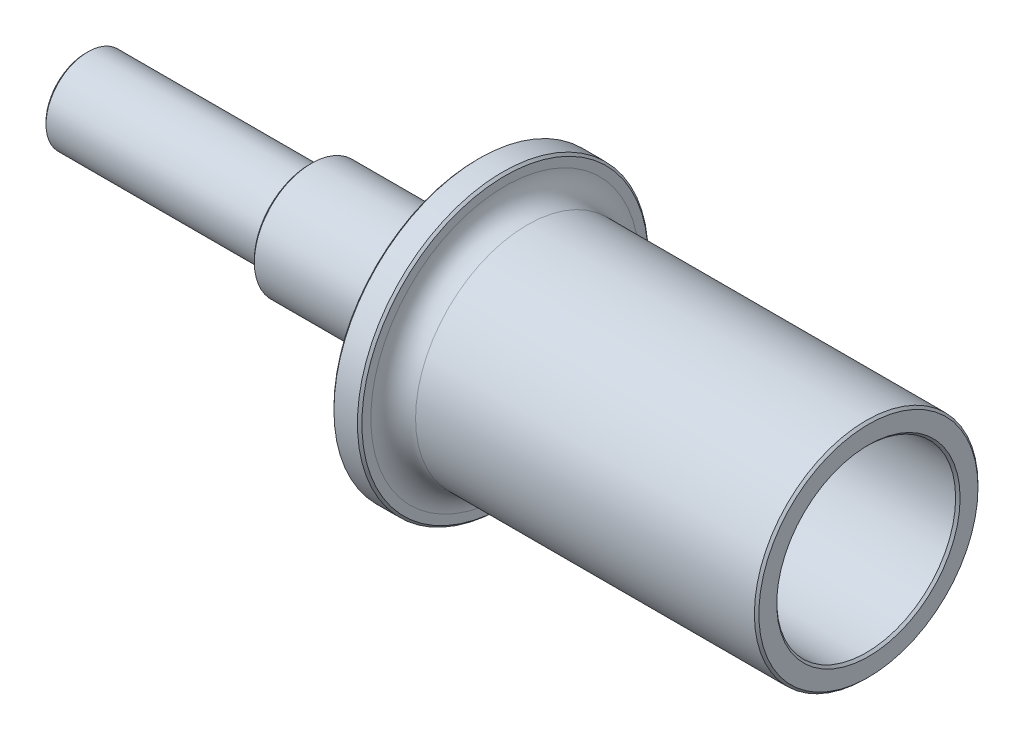
ISO-10303-21;
HEADER;
FILE_DESCRIPTION(('STEP AP214'),'2;1');
FILE_NAME('part.step','',(''),(''),'','','');
FILE_SCHEMA(('AUTOMOTIVE_DESIGN { 1 0 10303 214 1 1 1 1 }'));
ENDSEC;
DATA;
#1=APPLICATION_CONTEXT('core data for automotive mechanical design processes');
#2=APPLICATION_PROTOCOL_DEFINITION('international standard','automotive_design',2000,#1);
#3=PRODUCT_CONTEXT('',#1,'mechanical');
#4=PRODUCT('Part','Part','',(#3));
#5=PRODUCT_RELATED_PRODUCT_CATEGORY('part','',(#4));
#6=PRODUCT_DEFINITION_FORMATION('','',#4);
#7=PRODUCT_DEFINITION_CONTEXT('part definition',#1,'design');
#8=PRODUCT_DEFINITION('design','',#6,#7);
#9=PRODUCT_DEFINITION_SHAPE('','',#8);
#10=(LENGTH_UNIT() NAMED_UNIT(*) SI_UNIT(.MILLI.,.METRE.));
#11=(NAMED_UNIT(*) PLANE_ANGLE_UNIT() SI_UNIT($,.RADIAN.));
#12=(NAMED_UNIT(*) SI_UNIT($,.STERADIAN.) SOLID_ANGLE_UNIT());
#13=UNCERTAINTY_MEASURE_WITH_UNIT(LENGTH_MEASURE(1.E-05),#10,'distance_accuracy_value','');
#14=(GEOMETRIC_REPRESENTATION_CONTEXT(3) GLOBAL_UNCERTAINTY_ASSIGNED_CONTEXT((#13)) GLOBAL_UNIT_ASSIGNED_CONTEXT((#10,
#11,#12)) REPRESENTATION_CONTEXT('',''));
#15=CARTESIAN_POINT('',(0.,0.,0.));
#16=DIRECTION('',(0.,0.,1.));
#17=DIRECTION('',(1.,0.,0.));
#18=AXIS2_PLACEMENT_3D('',#15,#16,#17);
#19=CARTESIAN_POINT('',(-34.1764893476584,0.,-7.61999999999999));
#20=DIRECTION('',(1.,0.,0.));
#21=DIRECTION('',(0.,0.,-1.));
#22=AXIS2_PLACEMENT_3D('',#19,#20,#21);
#23=PLANE('',#22);
#24=CARTESIAN_POINT('',(-34.1764893476584,0.,0.));
#25=DIRECTION('',(1.,0.,0.));
#26=DIRECTION('',(0.,0.,-1.));
#27=AXIS2_PLACEMENT_3D('',#24,#25,#26);
#28=CIRCLE('',#27,7.61999999999999);
#29=CARTESIAN_POINT('',(-34.1764893476584,0.,-7.61999999999999));
#30=VERTEX_POINT('',#29);
#31=EDGE_CURVE('E103',#30,#30,#28,.T.);
#32=ORIENTED_EDGE('',*,*,#31,.T.);
#33=EDGE_LOOP('',(#32));
#34=FACE_BOUND('',#33,.T.);
#35=ADVANCED_FACE('F47',(#34),#23,.T.);
#36=CARTESIAN_POINT('',(-31.6364893476584,0.,0.));
#37=DIRECTION('',(1.,0.,0.));
#38=DIRECTION('',(0.,0.,-1.));
#39=AXIS2_PLACEMENT_3D('',#36,#37,#38);
#40=TOROIDAL_SURFACE('',#39,7.61999999999999,2.54);
#41=CARTESIAN_POINT('',(-31.6364893476584,0.,0.));
#42=DIRECTION('',(1.,0.,0.));
#43=DIRECTION('',(0.,0.,-1.));
#44=AXIS2_PLACEMENT_3D('',#41,#42,#43);
#45=CIRCLE('',#44,10.16);
#46=CARTESIAN_POINT('',(-31.6364893476584,0.,-10.16));
#47=VERTEX_POINT('',#46);
#48=EDGE_CURVE('E106',#47,#47,#45,.T.);
#49=ORIENTED_EDGE('',*,*,#48,.T.);
#50=EDGE_LOOP('',(#49));
#51=FACE_BOUND('',#50,.T.);
#52=ORIENTED_EDGE('',*,*,#31,.F.);
#53=EDGE_LOOP('',(#52));
#54=FACE_BOUND('',#53,.T.);
#55=ADVANCED_FACE('F133',(#51,#54),#40,.F.);
#56=CARTESIAN_POINT('',(0.,0.,0.));
#57=DIRECTION('',(1.,0.,0.));
#58=DIRECTION('',(0.,0.,-1.));
#59=AXIS2_PLACEMENT_3D('',#56,#57,#58);
#60=CYLINDRICAL_SURFACE('',#59,10.16);
#61=CARTESIAN_POINT('',(6.09600000000002,0.,0.));
#62=DIRECTION('',(1.,0.,0.));
#63=DIRECTION('',(0.,0.,-1.));
#64=AXIS2_PLACEMENT_3D('',#61,#62,#63);
#65=CIRCLE('',#64,10.16);
#66=CARTESIAN_POINT('',(6.09600000000002,0.,-10.16));
#67=VERTEX_POINT('',#66);
#68=EDGE_CURVE('E82',#67,#67,#65,.T.);
#69=ORIENTED_EDGE('',*,*,#68,.T.);
#70=EDGE_LOOP('',(#69));
#71=FACE_BOUND('',#70,.T.);
#72=ORIENTED_EDGE('',*,*,#48,.F.);
#73=EDGE_LOOP('',(#72));
#74=FACE_BOUND('',#73,.T.);
#75=ADVANCED_FACE('F139',(#71,#74),#60,.F.);
#76=CARTESIAN_POINT('',(6.35,0.,-10.16));
#77=DIRECTION('',(1.,0.,0.));
#78=DIRECTION('',(0.,0.,-1.));
#79=AXIS2_PLACEMENT_3D('',#76,#77,#78);
#80=PLANE('',#79);
#81=CARTESIAN_POINT('',(6.35,0.,0.));
#82=DIRECTION('',(1.,0.,0.));
#83=DIRECTION('',(0.,0.,-1.));
#84=AXIS2_PLACEMENT_3D('',#81,#82,#83);
#85=CIRCLE('',#84,10.414);
#86=CARTESIAN_POINT('',(6.35,0.,-10.414));
#87=VERTEX_POINT('',#86);
#88=EDGE_CURVE('E76',#87,#87,#85,.F.);
#89=ORIENTED_EDGE('',*,*,#88,.T.);
#90=EDGE_LOOP('',(#89));
#91=FACE_BOUND('',#90,.T.);
#92=CARTESIAN_POINT('',(6.35,0.,0.));
#93=DIRECTION('',(1.,0.,0.));
#94=DIRECTION('',(0.,0.,-1.));
#95=AXIS2_PLACEMENT_3D('',#92,#93,#94);
#96=CIRCLE('',#95,12.446);
#97=CARTESIAN_POINT('',(6.35,0.,-12.446));
#98=VERTEX_POINT('',#97);
#99=EDGE_CURVE('E79',#98,#98,#96,.T.);
#100=ORIENTED_EDGE('',*,*,#99,.T.);
#101=EDGE_LOOP('',(#100));
#102=FACE_BOUND('',#101,.T.);
#103=ADVANCED_FACE('F280',(#91,#102),#80,.T.);
#104=CARTESIAN_POINT('',(0.,0.,0.));
#105=DIRECTION('',(1.,0.,0.));
#106=DIRECTION('',(0.,0.,-1.));
#107=AXIS2_PLACEMENT_3D('',#104,#105,#106);
#108=CYLINDRICAL_SURFACE('',#107,12.7);
#109=CARTESIAN_POINT('',(6.09599999999998,0.,0.));
#110=DIRECTION('',(1.,0.,0.));
#111=DIRECTION('',(0.,0.,-1.));
#112=AXIS2_PLACEMENT_3D('',#109,#110,#111);
#113=CIRCLE('',#112,12.7);
#114=CARTESIAN_POINT('',(6.09599999999998,0.,-12.7));
#115=VERTEX_POINT('',#114);
#116=EDGE_CURVE('E73',#115,#115,#113,.F.);
#117=ORIENTED_EDGE('',*,*,#116,.T.);
#118=EDGE_LOOP('',(#117));
#119=FACE_BOUND('',#118,.T.);
#120=CARTESIAN_POINT('',(-32.385,0.,0.));
#121=DIRECTION('',(1.,0.,0.));
#122=DIRECTION('',(0.,0.,-1.));
#123=AXIS2_PLACEMENT_3D('',#120,#121,#122);
#124=CIRCLE('',#123,12.7);
#125=CARTESIAN_POINT('',(-32.385,0.,-12.7));
#126=VERTEX_POINT('',#125);
#127=EDGE_CURVE('E109',#126,#126,#124,.T.);
#128=ORIENTED_EDGE('',*,*,#127,.T.);
#129=EDGE_LOOP('',(#128));
#130=FACE_BOUND('',#129,.T.);
#131=ADVANCED_FACE('F130',(#119,#130),#108,.T.);
#132=CARTESIAN_POINT('',(-32.385,0.,0.));
#133=DIRECTION('',(1.,0.,0.));
#134=DIRECTION('',(0.,0.,-1.));
#135=AXIS2_PLACEMENT_3D('',#132,#133,#134);
#136=TOROIDAL_SURFACE('',#135,15.24,2.54);
#137=CARTESIAN_POINT('',(-34.925,0.,0.));
#138=DIRECTION('',(1.,0.,0.));
#139=DIRECTION('',(0.,0.,-1.));
#140=AXIS2_PLACEMENT_3D('',#137,#138,#139);
#141=CIRCLE('',#140,15.24);
#142=CARTESIAN_POINT('',(-34.925,0.,-15.24));
#143=VERTEX_POINT('',#142);
#144=EDGE_CURVE('E112',#143,#143,#141,.T.);
#145=ORIENTED_EDGE('',*,*,#144,.T.);
#146=EDGE_LOOP('',(#145));
#147=FACE_BOUND('',#146,.T.);
#148=ORIENTED_EDGE('',*,*,#127,.F.);
#149=EDGE_LOOP('',(#148));
#150=FACE_BOUND('',#149,.T.);
#151=ADVANCED_FACE('F116',(#147,#150),#136,.F.);
#152=CARTESIAN_POINT('',(-34.925,0.,-16.51));
#153=DIRECTION('',(1.,0.,0.));
#154=DIRECTION('',(0.,0.,-1.));
#155=AXIS2_PLACEMENT_3D('',#152,#153,#154);
#156=PLANE('',#155);
#157=CARTESIAN_POINT('',(-34.925,0.,0.));
#158=DIRECTION('',(1.,0.,0.));
#159=DIRECTION('',(0.,0.,-1.));
#160=AXIS2_PLACEMENT_3D('',#157,#158,#159);
#161=CIRCLE('',#160,16.256);
#162=CARTESIAN_POINT('',(-34.925,0.,-16.256));
#163=VERTEX_POINT('',#162);
#164=EDGE_CURVE('E12',#163,#163,#161,.T.);
#165=ORIENTED_EDGE('',*,*,#164,.T.);
#166=EDGE_LOOP('',(#165));
#167=FACE_BOUND('',#166,.T.);
#168=ORIENTED_EDGE('',*,*,#144,.F.);
#169=EDGE_LOOP('',(#168));
#170=FACE_BOUND('',#169,.T.);
#171=ADVANCED_FACE('F119',(#167,#170),#156,.T.);
#172=CARTESIAN_POINT('',(0.,0.,0.));
#173=DIRECTION('',(1.,0.,0.));
#174=DIRECTION('',(0.,0.,-1.));
#175=AXIS2_PLACEMENT_3D('',#172,#173,#174);
#176=CYLINDRICAL_SURFACE('',#175,16.51);
#177=CARTESIAN_POINT('',(-37.846,0.,0.));
#178=DIRECTION('',(-1.,0.,0.));
#179=DIRECTION('',(0.,0.,1.));
#180=AXIS2_PLACEMENT_3D('',#177,#178,#179);
#181=CIRCLE('',#180,16.51);
#182=CARTESIAN_POINT('',(-37.846,0.,16.51));
#183=VERTEX_POINT('',#182);
#184=EDGE_CURVE('E58',#183,#183,#181,.F.);
#185=ORIENTED_EDGE('',*,*,#184,.T.);
#186=EDGE_LOOP('',(#185));
#187=FACE_BOUND('',#186,.T.);
#188=CARTESIAN_POINT('',(-35.179,0.,0.));
#189=DIRECTION('',(1.,0.,0.));
#190=DIRECTION('',(0.,0.,-1.));
#191=AXIS2_PLACEMENT_3D('',#188,#189,#190);
#192=CIRCLE('',#191,16.51);
#193=CARTESIAN_POINT('',(-35.179,0.,-16.51));
#194=VERTEX_POINT('',#193);
#195=EDGE_CURVE('E62',#194,#194,#192,.F.);
#196=ORIENTED_EDGE('',*,*,#195,.T.);
#197=EDGE_LOOP('',(#196));
#198=FACE_BOUND('',#197,.T.);
#199=ADVANCED_FACE('F121',(#187,#198),#176,.T.);
#200=CARTESIAN_POINT('',(-38.1,0.,-16.51));
#201=DIRECTION('',(-1.,0.,0.));
#202=DIRECTION('',(0.,0.,1.));
#203=AXIS2_PLACEMENT_3D('',#200,#201,#202);
#204=PLANE('',#203);
#205=CARTESIAN_POINT('',(-38.1,0.,0.));
#206=DIRECTION('',(-1.,0.,0.));
#207=DIRECTION('',(0.,0.,1.));
#208=AXIS2_PLACEMENT_3D('',#205,#206,#207);
#209=CIRCLE('',#208,16.256);
#210=CARTESIAN_POINT('',(-38.1,0.,16.256));
#211=VERTEX_POINT('',#210);
#212=EDGE_CURVE('E54',#211,#211,#209,.T.);
#213=ORIENTED_EDGE('',*,*,#212,.T.);
#214=EDGE_LOOP('',(#213));
#215=FACE_BOUND('',#214,.T.);
#216=CARTESIAN_POINT('',(-38.1,0.,0.));
#217=DIRECTION('',(-1.,0.,0.));
#218=DIRECTION('',(0.,0.,1.));
#219=AXIS2_PLACEMENT_3D('',#216,#217,#218);
#220=CIRCLE('',#219,7.24999999999999);
#221=CARTESIAN_POINT('',(-38.1,0.,7.24999999999999));
#222=VERTEX_POINT('',#221);
#223=EDGE_CURVE('E100',#222,#222,#220,.F.);
#224=ORIENTED_EDGE('',*,*,#223,.T.);
#225=EDGE_LOOP('',(#224));
#226=FACE_BOUND('',#225,.T.);
#227=ADVANCED_FACE('F127',(#215,#226),#204,.T.);
#228=CARTESIAN_POINT('',(0.,0.,0.));
#229=DIRECTION('',(1.,0.,0.));
#230=DIRECTION('',(0.,0.,-1.));
#231=AXIS2_PLACEMENT_3D('',#228,#229,#230);
#232=CYLINDRICAL_SURFACE('',#231,6.49999999999999);
#233=CARTESIAN_POINT('',(-56.896,0.,0.));
#234=DIRECTION('',(-1.,0.,0.));
#235=DIRECTION('',(0.,0.,1.));
#236=AXIS2_PLACEMENT_3D('',#233,#234,#235);
#237=CIRCLE('',#236,6.49999999999999);
#238=CARTESIAN_POINT('',(-56.896,0.,6.49999999999999));
#239=VERTEX_POINT('',#238);
#240=EDGE_CURVE('E70',#239,#239,#237,.F.);
#241=ORIENTED_EDGE('',*,*,#240,.T.);
#242=EDGE_LOOP('',(#241));
#243=FACE_BOUND('',#242,.T.);
#244=CARTESIAN_POINT('',(-38.85,0.,0.));
#245=DIRECTION('',(-1.,0.,0.));
#246=DIRECTION('',(0.,0.,1.));
#247=AXIS2_PLACEMENT_3D('',#244,#245,#246);
#248=CIRCLE('',#247,6.49999999999999);
#249=CARTESIAN_POINT('',(-38.85,0.,6.49999999999999));
#250=VERTEX_POINT('',#249);
#251=EDGE_CURVE('E97',#250,#250,#248,.T.);
#252=ORIENTED_EDGE('',*,*,#251,.T.);
#253=EDGE_LOOP('',(#252));
#254=FACE_BOUND('',#253,.T.);
#255=ADVANCED_FACE('F242',(#243,#254),#232,.T.);
#256=CARTESIAN_POINT('',(-57.15,0.,-6.49999999999999));
#257=DIRECTION('',(-1.,0.,0.));
#258=DIRECTION('',(0.,0.,1.));
#259=AXIS2_PLACEMENT_3D('',#256,#257,#258);
#260=PLANE('',#259);
#261=CARTESIAN_POINT('',(-57.15,0.,0.));
#262=DIRECTION('',(-1.,0.,0.));
#263=DIRECTION('',(0.,0.,1.));
#264=AXIS2_PLACEMENT_3D('',#261,#262,#263);
#265=CIRCLE('',#264,6.24599999999997);
#266=CARTESIAN_POINT('',(-57.15,0.,6.24599999999997));
#267=VERTEX_POINT('',#266);
#268=EDGE_CURVE('E67',#267,#267,#265,.T.);
#269=ORIENTED_EDGE('',*,*,#268,.T.);
#270=EDGE_LOOP('',(#269));
#271=FACE_BOUND('',#270,.T.);
#272=CARTESIAN_POINT('',(-57.15,0.,0.));
#273=DIRECTION('',(-1.,0.,0.));
#274=DIRECTION('',(0.,0.,1.));
#275=AXIS2_PLACEMENT_3D('',#272,#273,#274);
#276=CIRCLE('',#275,5.51249999999999);
#277=CARTESIAN_POINT('',(-57.15,0.,5.51249999999999));
#278=VERTEX_POINT('',#277);
#279=EDGE_CURVE('E94',#278,#278,#276,.F.);
#280=ORIENTED_EDGE('',*,*,#279,.T.);
#281=EDGE_LOOP('',(#280));
#282=FACE_BOUND('',#281,.T.);
#283=ADVANCED_FACE('F232',(#271,#282),#260,.T.);
#284=CARTESIAN_POINT('',(0.,0.,0.));
#285=DIRECTION('',(1.,0.,0.));
#286=DIRECTION('',(0.,0.,-1.));
#287=AXIS2_PLACEMENT_3D('',#284,#285,#286);
#288=CYLINDRICAL_SURFACE('',#287,4.76249999999999);
#289=CARTESIAN_POINT('',(-82.296,0.,0.));
#290=DIRECTION('',(-1.,0.,0.));
#291=DIRECTION('',(0.,0.,1.));
#292=AXIS2_PLACEMENT_3D('',#289,#290,#291);
#293=CIRCLE('',#292,4.76249999999999);
#294=CARTESIAN_POINT('',(-82.296,0.,4.76249999999999));
#295=VERTEX_POINT('',#294);
#296=EDGE_CURVE('E88',#295,#295,#293,.F.);
#297=ORIENTED_EDGE('',*,*,#296,.T.);
#298=EDGE_LOOP('',(#297));
#299=FACE_BOUND('',#298,.T.);
#300=CARTESIAN_POINT('',(-57.9,0.,0.));
#301=DIRECTION('',(-1.,0.,0.));
#302=DIRECTION('',(0.,0.,1.));
#303=AXIS2_PLACEMENT_3D('',#300,#301,#302);
#304=CIRCLE('',#303,4.76249999999999);
#305=CARTESIAN_POINT('',(-57.9,0.,4.76249999999999));
#306=VERTEX_POINT('',#305);
#307=EDGE_CURVE('E91',#306,#306,#304,.T.);
#308=ORIENTED_EDGE('',*,*,#307,.T.);
#309=EDGE_LOOP('',(#308));
#310=FACE_BOUND('',#309,.T.);
#311=ADVANCED_FACE('F220',(#299,#310),#288,.T.);
#312=CARTESIAN_POINT('',(-82.55,0.,0.));
#313=DIRECTION('',(-1.,0.,0.));
#314=DIRECTION('',(0.,0.,1.));
#315=AXIS2_PLACEMENT_3D('',#312,#313,#314);
#316=PLANE('',#315);
#317=CARTESIAN_POINT('',(-82.55,0.,0.));
#318=DIRECTION('',(-1.,0.,0.));
#319=DIRECTION('',(0.,0.,1.));
#320=AXIS2_PLACEMENT_3D('',#317,#318,#319);
#321=CIRCLE('',#320,4.50849999999994);
#322=CARTESIAN_POINT('',(-82.55,0.,4.50849999999994));
#323=VERTEX_POINT('',#322);
#324=EDGE_CURVE('E85',#323,#323,#321,.T.);
#325=ORIENTED_EDGE('',*,*,#324,.T.);
#326=EDGE_LOOP('',(#325));
#327=FACE_BOUND('',#326,.T.);
#328=ADVANCED_FACE('F148',(#327),#316,.T.);
#329=CARTESIAN_POINT('',(-38.85,0.,0.));
#330=DIRECTION('',(-1.,0.,0.));
#331=DIRECTION('',(0.,0.,1.));
#332=AXIS2_PLACEMENT_3D('',#329,#330,#331);
#333=TOROIDAL_SURFACE('',#332,7.24999999999999,0.75);
#334=ORIENTED_EDGE('',*,*,#251,.F.);
#335=EDGE_LOOP('',(#334));
#336=FACE_BOUND('',#335,.T.);
#337=ORIENTED_EDGE('',*,*,#223,.F.);
#338=EDGE_LOOP('',(#337));
#339=FACE_BOUND('',#338,.T.);
#340=ADVANCED_FACE('F144',(#336,#339),#333,.F.);
#341=CARTESIAN_POINT('',(-57.9,0.,0.));
#342=DIRECTION('',(-1.,0.,0.));
#343=DIRECTION('',(0.,0.,1.));
#344=AXIS2_PLACEMENT_3D('',#341,#342,#343);
#345=TOROIDAL_SURFACE('',#344,5.51249999999999,0.75);
#346=ORIENTED_EDGE('',*,*,#307,.F.);
#347=EDGE_LOOP('',(#346));
#348=FACE_BOUND('',#347,.T.);
#349=ORIENTED_EDGE('',*,*,#279,.F.);
#350=EDGE_LOOP('',(#349));
#351=FACE_BOUND('',#350,.T.);
#352=ADVANCED_FACE('F147',(#348,#351),#345,.F.);
#353=CARTESIAN_POINT('',(-82.296,0.,0.));
#354=DIRECTION('',(1.,0.,0.));
#355=DIRECTION('',(0.,0.,-1.));
#356=AXIS2_PLACEMENT_3D('',#353,#354,#355);
#357=CONICAL_SURFACE('',#356,4.76249999999999,0.785398163397453);
#358=ORIENTED_EDGE('',*,*,#324,.F.);
#359=EDGE_LOOP('',(#358));
#360=FACE_BOUND('',#359,.T.);
#361=ORIENTED_EDGE('',*,*,#296,.F.);
#362=EDGE_LOOP('',(#361));
#363=FACE_BOUND('',#362,.T.);
#364=ADVANCED_FACE('F152',(#360,#363),#357,.T.);
#365=CARTESIAN_POINT('',(6.09600000000002,0.,0.));
#366=DIRECTION('',(1.,0.,0.));
#367=DIRECTION('',(0.,0.,-1.));
#368=AXIS2_PLACEMENT_3D('',#365,#366,#367);
#369=CONICAL_SURFACE('',#368,10.16,0.785398163397462);
#370=ORIENTED_EDGE('',*,*,#88,.F.);
#371=EDGE_LOOP('',(#370));
#372=FACE_BOUND('',#371,.T.);
#373=ORIENTED_EDGE('',*,*,#68,.F.);
#374=EDGE_LOOP('',(#373));
#375=FACE_BOUND('',#374,.T.);
#376=ADVANCED_FACE('F156',(#372,#375),#369,.F.);
#377=CARTESIAN_POINT('',(6.35,0.,0.));
#378=DIRECTION('',(-1.,0.,0.));
#379=DIRECTION('',(0.,0.,1.));
#380=AXIS2_PLACEMENT_3D('',#377,#378,#379);
#381=CONICAL_SURFACE('',#380,12.446,0.785398163397442);
#382=ORIENTED_EDGE('',*,*,#116,.F.);
#383=EDGE_LOOP('',(#382));
#384=FACE_BOUND('',#383,.T.);
#385=ORIENTED_EDGE('',*,*,#99,.F.);
#386=EDGE_LOOP('',(#385));
#387=FACE_BOUND('',#386,.T.);
#388=ADVANCED_FACE('F160',(#384,#387),#381,.T.);
#389=CARTESIAN_POINT('',(-56.896,0.,0.));
#390=DIRECTION('',(1.,0.,0.));
#391=DIRECTION('',(0.,0.,-1.));
#392=AXIS2_PLACEMENT_3D('',#389,#390,#391);
#393=CONICAL_SURFACE('',#392,6.49999999999999,0.785398163397464);
#394=ORIENTED_EDGE('',*,*,#268,.F.);
#395=EDGE_LOOP('',(#394));
#396=FACE_BOUND('',#395,.T.);
#397=ORIENTED_EDGE('',*,*,#240,.F.);
#398=EDGE_LOOP('',(#397));
#399=FACE_BOUND('',#398,.T.);
#400=ADVANCED_FACE('F164',(#396,#399),#393,.T.);
#401=CARTESIAN_POINT('',(-37.846,0.,0.));
#402=DIRECTION('',(1.,0.,0.));
#403=DIRECTION('',(0.,0.,-1.));
#404=AXIS2_PLACEMENT_3D('',#401,#402,#403);
#405=CONICAL_SURFACE('',#404,16.51,0.785398163397462);
#406=ORIENTED_EDGE('',*,*,#212,.F.);
#407=EDGE_LOOP('',(#406));
#408=FACE_BOUND('',#407,.T.);
#409=ORIENTED_EDGE('',*,*,#184,.F.);
#410=EDGE_LOOP('',(#409));
#411=FACE_BOUND('',#410,.T.);
#412=ADVANCED_FACE('F167',(#408,#411),#405,.T.);
#413=CARTESIAN_POINT('',(-34.925,0.,0.));
#414=DIRECTION('',(-1.,0.,0.));
#415=DIRECTION('',(0.,0.,1.));
#416=AXIS2_PLACEMENT_3D('',#413,#414,#415);
#417=CONICAL_SURFACE('',#416,16.256,0.785398163397489);
#418=ORIENTED_EDGE('',*,*,#195,.F.);
#419=EDGE_LOOP('',(#418));
#420=FACE_BOUND('',#419,.T.);
#421=ORIENTED_EDGE('',*,*,#164,.F.);
#422=EDGE_LOOP('',(#421));
#423=FACE_BOUND('',#422,.T.);
#424=ADVANCED_FACE('F49',(#420,#423),#417,.T.);
#425=CLOSED_SHELL('',(#35,#55,#75,#103,#131,#151,#171,#199,#227,#255,#283,#311,#328,#340,#352,
#364,#376,#388,#400,#412,#424));
#426=MANIFOLD_SOLID_BREP('B2',#425);
#427=ADVANCED_BREP_SHAPE_REPRESENTATION('',(#18,#426),#14);
#428=SHAPE_DEFINITION_REPRESENTATION(#9,#427);
ENDSEC;
END-ISO-10303-21;
